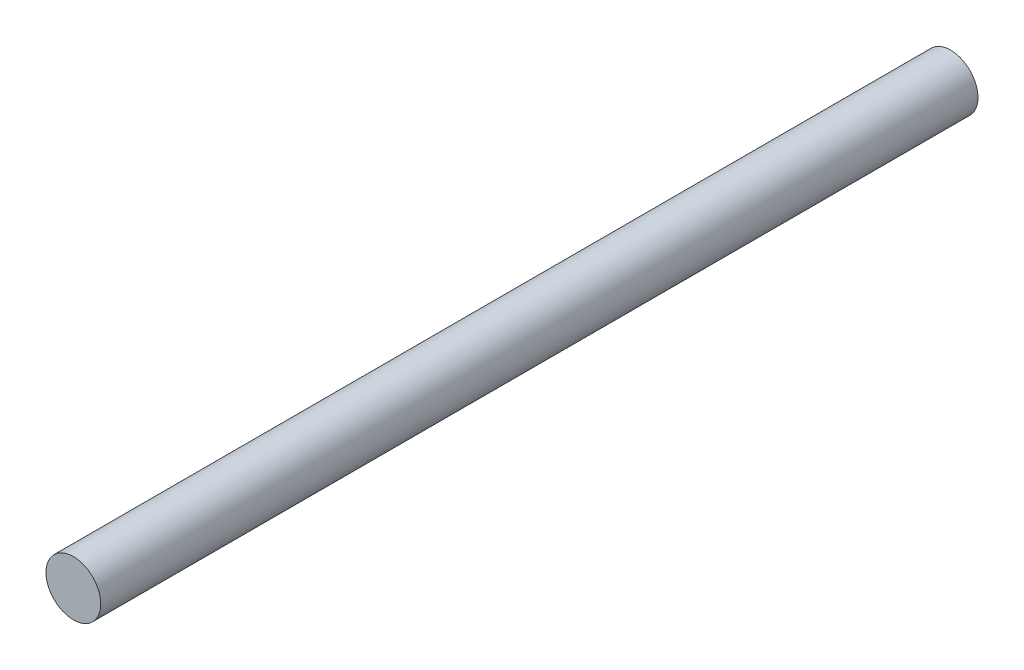
ISO-10303-21;
HEADER;
FILE_DESCRIPTION(('STEP AP214'),'2;1');
FILE_NAME('part.step','',(''),(''),'','','');
FILE_SCHEMA(('AUTOMOTIVE_DESIGN { 1 0 10303 214 1 1 1 1 }'));
ENDSEC;
DATA;
#1=APPLICATION_CONTEXT('core data for automotive mechanical design processes');
#2=APPLICATION_PROTOCOL_DEFINITION('international standard','automotive_design',2000,#1);
#3=PRODUCT_CONTEXT('',#1,'mechanical');
#4=PRODUCT('Part','Part','',(#3));
#5=PRODUCT_RELATED_PRODUCT_CATEGORY('part','',(#4));
#6=PRODUCT_DEFINITION_FORMATION('','',#4);
#7=PRODUCT_DEFINITION_CONTEXT('part definition',#1,'design');
#8=PRODUCT_DEFINITION('design','',#6,#7);
#9=PRODUCT_DEFINITION_SHAPE('','',#8);
#10=(LENGTH_UNIT() NAMED_UNIT(*) SI_UNIT(.MILLI.,.METRE.));
#11=(NAMED_UNIT(*) PLANE_ANGLE_UNIT() SI_UNIT($,.RADIAN.));
#12=(NAMED_UNIT(*) SI_UNIT($,.STERADIAN.) SOLID_ANGLE_UNIT());
#13=UNCERTAINTY_MEASURE_WITH_UNIT(LENGTH_MEASURE(1.E-05),#10,'distance_accuracy_value','');
#14=(GEOMETRIC_REPRESENTATION_CONTEXT(3) GLOBAL_UNCERTAINTY_ASSIGNED_CONTEXT((#13)) GLOBAL_UNIT_ASSIGNED_CONTEXT((#10,
#11,#12)) REPRESENTATION_CONTEXT('',''));
#15=CARTESIAN_POINT('',(0.,0.,0.));
#16=DIRECTION('',(0.,0.,1.));
#17=DIRECTION('',(1.,0.,0.));
#18=AXIS2_PLACEMENT_3D('',#15,#16,#17);
#19=CARTESIAN_POINT('',(0.,0.,76.2));
#20=DIRECTION('',(0.,0.,-1.));
#21=DIRECTION('',(-1.,0.,0.));
#22=AXIS2_PLACEMENT_3D('',#19,#20,#21);
#23=CYLINDRICAL_SURFACE('',#22,2.38125);
#24=CARTESIAN_POINT('',(0.,0.,76.2));
#25=DIRECTION('',(0.,0.,1.));
#26=DIRECTION('',(1.,0.,0.));
#27=AXIS2_PLACEMENT_3D('',#24,#25,#26);
#28=CIRCLE('',#27,2.38125);
#29=CARTESIAN_POINT('',(2.38125,0.,76.2));
#30=VERTEX_POINT('',#29);
#31=EDGE_CURVE('E10',#30,#30,#28,.T.);
#32=ORIENTED_EDGE('',*,*,#31,.F.);
#33=EDGE_LOOP('',(#32));
#34=FACE_BOUND('',#33,.T.);
#35=CARTESIAN_POINT('',(0.,0.,0.));
#36=DIRECTION('',(0.,0.,1.));
#37=DIRECTION('',(1.,0.,0.));
#38=AXIS2_PLACEMENT_3D('',#35,#36,#37);
#39=CIRCLE('',#38,2.38125);
#40=CARTESIAN_POINT('',(2.38125,0.,0.));
#41=VERTEX_POINT('',#40);
#42=EDGE_CURVE('E34',#41,#41,#39,.T.);
#43=ORIENTED_EDGE('',*,*,#42,.T.);
#44=EDGE_LOOP('',(#43));
#45=FACE_BOUND('',#44,.T.);
#46=ADVANCED_FACE('F31',(#34,#45),#23,.T.);
#47=CARTESIAN_POINT('',(0.,0.,76.2));
#48=DIRECTION('',(0.,0.,1.));
#49=DIRECTION('',(1.,0.,0.));
#50=AXIS2_PLACEMENT_3D('',#47,#48,#49);
#51=PLANE('',#50);
#52=ORIENTED_EDGE('',*,*,#31,.T.);
#53=EDGE_LOOP('',(#52));
#54=FACE_BOUND('',#53,.T.);
#55=ADVANCED_FACE('F46',(#54),#51,.T.);
#56=CARTESIAN_POINT('',(0.,0.,0.));
#57=DIRECTION('',(0.,0.,1.));
#58=DIRECTION('',(1.,0.,0.));
#59=AXIS2_PLACEMENT_3D('',#56,#57,#58);
#60=PLANE('',#59);
#61=ORIENTED_EDGE('',*,*,#42,.F.);
#62=EDGE_LOOP('',(#61));
#63=FACE_BOUND('',#62,.T.);
#64=ADVANCED_FACE('F44',(#63),#60,.F.);
#65=CLOSED_SHELL('',(#46,#55,#64));
#66=MANIFOLD_SOLID_BREP('B2',#65);
#67=ADVANCED_BREP_SHAPE_REPRESENTATION('',(#18,#66),#14);
#68=SHAPE_DEFINITION_REPRESENTATION(#9,#67);
ENDSEC;
END-ISO-10303-21;
